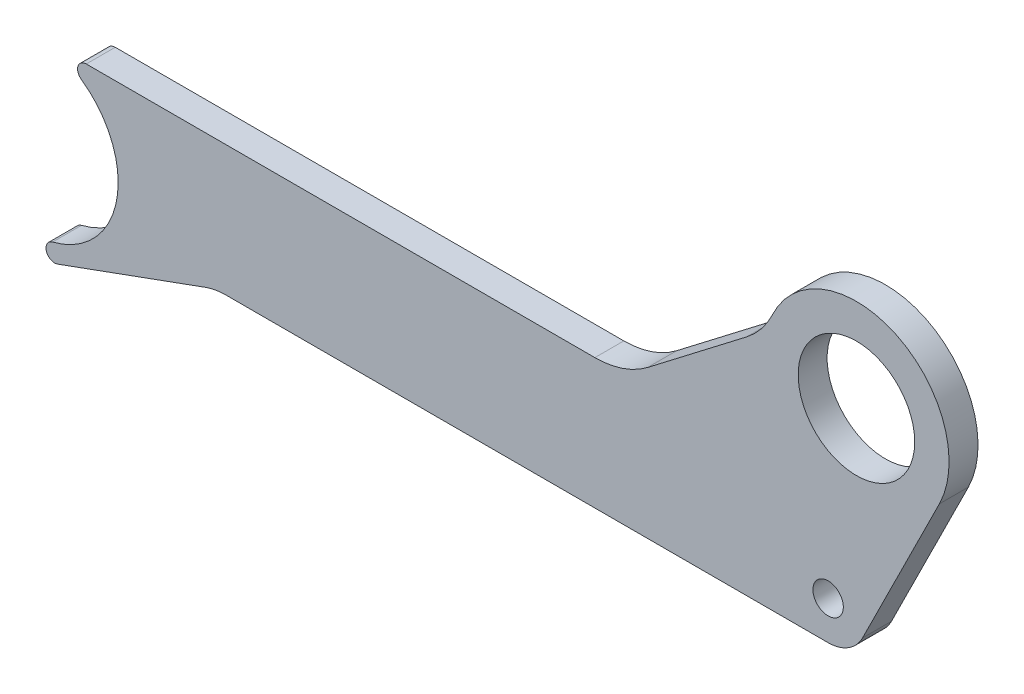
ISO-10303-21;
HEADER;
FILE_DESCRIPTION(('STEP AP214'),'2;1');
FILE_NAME('part.step','',(''),(''),'','','');
FILE_SCHEMA(('AUTOMOTIVE_DESIGN { 1 0 10303 214 1 1 1 1 }'));
ENDSEC;
DATA;
#1=APPLICATION_CONTEXT('core data for automotive mechanical design processes');
#2=APPLICATION_PROTOCOL_DEFINITION('international standard','automotive_design',2000,#1);
#3=PRODUCT_CONTEXT('',#1,'mechanical');
#4=PRODUCT('Part','Part','',(#3));
#5=PRODUCT_RELATED_PRODUCT_CATEGORY('part','',(#4));
#6=PRODUCT_DEFINITION_FORMATION('','',#4);
#7=PRODUCT_DEFINITION_CONTEXT('part definition',#1,'design');
#8=PRODUCT_DEFINITION('design','',#6,#7);
#9=PRODUCT_DEFINITION_SHAPE('','',#8);
#10=(LENGTH_UNIT() NAMED_UNIT(*) SI_UNIT(.MILLI.,.METRE.));
#11=(NAMED_UNIT(*) PLANE_ANGLE_UNIT() SI_UNIT($,.RADIAN.));
#12=(NAMED_UNIT(*) SI_UNIT($,.STERADIAN.) SOLID_ANGLE_UNIT());
#13=UNCERTAINTY_MEASURE_WITH_UNIT(LENGTH_MEASURE(1.E-05),#10,'distance_accuracy_value','');
#14=(GEOMETRIC_REPRESENTATION_CONTEXT(3) GLOBAL_UNCERTAINTY_ASSIGNED_CONTEXT((#13)) GLOBAL_UNIT_ASSIGNED_CONTEXT((#10,
#11,#12)) REPRESENTATION_CONTEXT('',''));
#15=CARTESIAN_POINT('',(0.,0.,0.));
#16=DIRECTION('',(0.,0.,1.));
#17=DIRECTION('',(1.,0.,0.));
#18=AXIS2_PLACEMENT_3D('',#15,#16,#17);
#19=CARTESIAN_POINT('',(-266.02633403899,-33.,10.));
#20=DIRECTION('',(0.,0.,1.));
#21=DIRECTION('',(1.,0.,0.));
#22=AXIS2_PLACEMENT_3D('',#19,#20,#21);
#23=PLANE('',#22);
#24=CARTESIAN_POINT('',(0.,0.,10.));
#25=DIRECTION('',(0.,0.,1.));
#26=DIRECTION('',(1.,0.,0.));
#27=AXIS2_PLACEMENT_3D('',#24,#25,#26);
#28=CIRCLE('',#27,20.125);
#29=CARTESIAN_POINT('',(20.125,0.,10.));
#30=VERTEX_POINT('',#29);
#31=EDGE_CURVE('E174',#30,#30,#28,.T.);
#32=ORIENTED_EDGE('',*,*,#31,.F.);
#33=EDGE_LOOP('',(#32));
#34=FACE_BOUND('',#33,.T.);
#35=CARTESIAN_POINT('',(-266.02633403899,-33.,10.));
#36=DIRECTION('',(0.,0.,1.));
#37=DIRECTION('',(1.,0.,0.));
#38=AXIS2_PLACEMENT_3D('',#35,#36,#37);
#39=CIRCLE('',#38,3.00000000000001);
#40=CARTESIAN_POINT('',(-266.026334038989,-30.,10.));
#41=VERTEX_POINT('',#40);
#42=CARTESIAN_POINT('',(-267.751212762718,-35.4545454545455,10.));
#43=VERTEX_POINT('',#42);
#44=EDGE_CURVE('E195',#41,#43,#39,.T.);
#45=ORIENTED_EDGE('',*,*,#44,.T.);
#46=CARTESIAN_POINT('',(-284.999999999999,-60.,10.));
#47=DIRECTION('',(0.,0.,-1.));
#48=DIRECTION('',(-1.,0.,0.));
#49=AXIS2_PLACEMENT_3D('',#46,#47,#48);
#50=CIRCLE('',#49,30.);
#51=CARTESIAN_POINT('',(-277.670674774274,-89.0909090909091,10.));
#52=VERTEX_POINT('',#51);
#53=EDGE_CURVE('E118',#43,#52,#50,.T.);
#54=ORIENTED_EDGE('',*,*,#53,.T.);
#55=CARTESIAN_POINT('',(-276.937742251701,-92.,10.));
#56=DIRECTION('',(0.,0.,1.));
#57=DIRECTION('',(1.,0.,0.));
#58=AXIS2_PLACEMENT_3D('',#55,#56,#57);
#59=CIRCLE('',#58,2.99999999999999);
#60=CARTESIAN_POINT('',(-275.911681821724,-94.8190778623577,10.));
#61=VERTEX_POINT('',#60);
#62=EDGE_CURVE('E225',#52,#61,#59,.T.);
#63=ORIENTED_EDGE('',*,*,#62,.T.);
#64=DIRECTION('',(0.939692620785908,0.342020143325671,0.));
#65=VECTOR('',#64,1.);
#66=CARTESIAN_POINT('',(-275.911681821724,-94.8190778623577,10.));
#67=LINE('',#66,#65);
#68=CARTESIAN_POINT('',(-224.773076172828,-76.2061475842819,10.));
#69=VERTEX_POINT('',#68);
#70=EDGE_CURVE('E244',#61,#69,#67,.T.);
#71=ORIENTED_EDGE('',*,*,#70,.T.);
#72=CARTESIAN_POINT('',(-217.932673306315,-95.,10.));
#73=DIRECTION('',(0.,0.,-1.));
#74=DIRECTION('',(1.,0.,0.));
#75=AXIS2_PLACEMENT_3D('',#72,#73,#74);
#76=CIRCLE('',#75,20.);
#77=CARTESIAN_POINT('',(-217.932673306315,-75.,10.));
#78=VERTEX_POINT('',#77);
#79=EDGE_CURVE('E241',#69,#78,#76,.T.);
#80=ORIENTED_EDGE('',*,*,#79,.T.);
#81=DIRECTION('',(1.,0.,0.));
#82=VECTOR('',#81,1.);
#83=CARTESIAN_POINT('',(-217.932673306315,-75.,10.));
#84=LINE('',#83,#82);
#85=CARTESIAN_POINT('',(-9.77715406501423,-75.,10.));
#86=VERTEX_POINT('',#85);
#87=EDGE_CURVE('E243',#78,#86,#84,.T.);
#88=ORIENTED_EDGE('',*,*,#87,.T.);
#89=CARTESIAN_POINT('',(-9.77715406501423,-61.7305212871962,10.));
#90=DIRECTION('',(0.,0.,1.));
#91=DIRECTION('',(1.,0.,0.));
#92=AXIS2_PLACEMENT_3D('',#89,#90,#91);
#93=CIRCLE('',#92,13.2694787128039);
#94=CARTESIAN_POINT('',(2.10446710968015,-67.6386634292412,10.));
#95=VERTEX_POINT('',#94);
#96=EDGE_CURVE('E246',#86,#95,#93,.T.);
#97=ORIENTED_EDGE('',*,*,#96,.T.);
#98=DIRECTION('',(0.445242972231018,0.895409792038756,0.));
#99=VECTOR('',#98,1.);
#100=CARTESIAN_POINT('',(2.10446710968015,-67.6386634292412,10.));
#101=LINE('',#100,#99);
#102=CARTESIAN_POINT('',(28.6531133452401,-14.2477751113926,10.));
#103=VERTEX_POINT('',#102);
#104=EDGE_CURVE('E252',#95,#103,#101,.T.);
#105=ORIENTED_EDGE('',*,*,#104,.T.);
#106=CARTESIAN_POINT('',(0.,0.,10.));
#107=DIRECTION('',(0.,0.,1.));
#108=DIRECTION('',(1.,0.,0.));
#109=AXIS2_PLACEMENT_3D('',#106,#107,#108);
#110=CIRCLE('',#109,32.);
#111=CARTESIAN_POINT('',(-28.9993311751464,13.5291829536814,10.));
#112=VERTEX_POINT('',#111);
#113=EDGE_CURVE('E254',#103,#112,#110,.T.);
#114=ORIENTED_EDGE('',*,*,#113,.T.);
#115=CARTESIAN_POINT('',(-56.1862041518462,26.2127919727577,10.));
#116=DIRECTION('',(0.,0.,-1.));
#117=DIRECTION('',(1.,0.,0.));
#118=AXIS2_PLACEMENT_3D('',#115,#116,#117);
#119=CIRCLE('',#118,30.);
#120=CARTESIAN_POINT('',(-37.9233612815846,2.41219176402055,10.));
#121=VERTEX_POINT('',#120);
#122=EDGE_CURVE('E152',#112,#121,#119,.T.);
#123=ORIENTED_EDGE('',*,*,#122,.T.);
#124=DIRECTION('',(-0.793353340291238,-0.608761429008716,0.));
#125=VECTOR('',#124,1.);
#126=CARTESIAN_POINT('',(-37.9233612815846,2.41219176402055,10.));
#127=LINE('',#126,#125);
#128=CARTESIAN_POINT('',(-72.084536873491,-23.8006002087372,10.));
#129=VERTEX_POINT('',#128);
#130=EDGE_CURVE('E146',#121,#129,#127,.T.);
#131=ORIENTED_EDGE('',*,*,#130,.T.);
#132=CARTESIAN_POINT('',(-90.3473797437526,0.,10.));
#133=DIRECTION('',(0.,0.,-1.));
#134=DIRECTION('',(-1.,0.,0.));
#135=AXIS2_PLACEMENT_3D('',#132,#133,#134);
#136=CIRCLE('',#135,30.);
#137=CARTESIAN_POINT('',(-90.3473797437522,-30.,10.));
#138=VERTEX_POINT('',#137);
#139=EDGE_CURVE('E150',#129,#138,#136,.T.);
#140=ORIENTED_EDGE('',*,*,#139,.T.);
#141=DIRECTION('',(-1.,0.,0.));
#142=VECTOR('',#141,1.);
#143=CARTESIAN_POINT('',(-90.3473797437522,-30.,10.));
#144=LINE('',#143,#142);
#145=EDGE_CURVE('E60',#138,#41,#144,.T.);
#146=ORIENTED_EDGE('',*,*,#145,.T.);
#147=EDGE_LOOP('',(#45,#54,#63,#71,#80,#88,#97,#105,#114,#123,#131,#140,#146));
#148=FACE_BOUND('',#147,.T.);
#149=CARTESIAN_POINT('',(-9.77715406501423,-61.7305212871962,10.));
#150=DIRECTION('',(0.,0.,1.));
#151=DIRECTION('',(1.,0.,0.));
#152=AXIS2_PLACEMENT_3D('',#149,#150,#151);
#153=CIRCLE('',#152,5.25);
#154=CARTESIAN_POINT('',(-4.52715406501423,-61.7305212871962,10.));
#155=VERTEX_POINT('',#154);
#156=EDGE_CURVE('E297',#155,#155,#153,.T.);
#157=ORIENTED_EDGE('',*,*,#156,.F.);
#158=EDGE_LOOP('',(#157));
#159=FACE_BOUND('',#158,.T.);
#160=ADVANCED_FACE('F43',(#34,#148,#159),#23,.T.);
#161=CARTESIAN_POINT('',(-266.02633403899,-33.,0.));
#162=DIRECTION('',(0.,0.,1.));
#163=DIRECTION('',(1.,0.,0.));
#164=AXIS2_PLACEMENT_3D('',#161,#162,#163);
#165=PLANE('',#164);
#166=CARTESIAN_POINT('',(0.,0.,0.));
#167=DIRECTION('',(0.,0.,1.));
#168=DIRECTION('',(1.,0.,0.));
#169=AXIS2_PLACEMENT_3D('',#166,#167,#168);
#170=CIRCLE('',#169,20.125);
#171=CARTESIAN_POINT('',(20.125,0.,0.));
#172=VERTEX_POINT('',#171);
#173=EDGE_CURVE('E302',#172,#172,#170,.T.);
#174=ORIENTED_EDGE('',*,*,#173,.T.);
#175=EDGE_LOOP('',(#174));
#176=FACE_BOUND('',#175,.T.);
#177=CARTESIAN_POINT('',(-266.02633403899,-33.,0.));
#178=DIRECTION('',(0.,0.,1.));
#179=DIRECTION('',(1.,0.,0.));
#180=AXIS2_PLACEMENT_3D('',#177,#178,#179);
#181=CIRCLE('',#180,3.00000000000001);
#182=CARTESIAN_POINT('',(-266.026334038989,-30.,0.));
#183=VERTEX_POINT('',#182);
#184=CARTESIAN_POINT('',(-267.751212762718,-35.4545454545455,0.));
#185=VERTEX_POINT('',#184);
#186=EDGE_CURVE('E170',#183,#185,#181,.T.);
#187=ORIENTED_EDGE('',*,*,#186,.F.);
#188=DIRECTION('',(-1.,0.,0.));
#189=VECTOR('',#188,1.);
#190=CARTESIAN_POINT('',(-90.3473797437522,-30.,0.));
#191=LINE('',#190,#189);
#192=CARTESIAN_POINT('',(-90.3473797437522,-30.,0.));
#193=VERTEX_POINT('',#192);
#194=EDGE_CURVE('E110',#193,#183,#191,.T.);
#195=ORIENTED_EDGE('',*,*,#194,.F.);
#196=CARTESIAN_POINT('',(-90.3473797437526,0.,0.));
#197=DIRECTION('',(0.,0.,-1.));
#198=DIRECTION('',(-1.,0.,0.));
#199=AXIS2_PLACEMENT_3D('',#196,#197,#198);
#200=CIRCLE('',#199,30.);
#201=CARTESIAN_POINT('',(-72.084536873491,-23.8006002087372,0.));
#202=VERTEX_POINT('',#201);
#203=EDGE_CURVE('E104',#202,#193,#200,.T.);
#204=ORIENTED_EDGE('',*,*,#203,.F.);
#205=DIRECTION('',(-0.793353340291238,-0.608761429008716,0.));
#206=VECTOR('',#205,1.);
#207=CARTESIAN_POINT('',(-37.9233612815846,2.41219176402055,0.));
#208=LINE('',#207,#206);
#209=CARTESIAN_POINT('',(-37.9233612815846,2.41219176402055,0.));
#210=VERTEX_POINT('',#209);
#211=EDGE_CURVE('E160',#210,#202,#208,.T.);
#212=ORIENTED_EDGE('',*,*,#211,.F.);
#213=CARTESIAN_POINT('',(-56.1862041518462,26.2127919727577,0.));
#214=DIRECTION('',(0.,0.,-1.));
#215=DIRECTION('',(1.,0.,0.));
#216=AXIS2_PLACEMENT_3D('',#213,#214,#215);
#217=CIRCLE('',#216,30.);
#218=CARTESIAN_POINT('',(-28.9993311751464,13.5291829536814,0.));
#219=VERTEX_POINT('',#218);
#220=EDGE_CURVE('E190',#219,#210,#217,.T.);
#221=ORIENTED_EDGE('',*,*,#220,.F.);
#222=CARTESIAN_POINT('',(0.,0.,0.));
#223=DIRECTION('',(0.,0.,1.));
#224=DIRECTION('',(1.,0.,0.));
#225=AXIS2_PLACEMENT_3D('',#222,#223,#224);
#226=CIRCLE('',#225,32.);
#227=CARTESIAN_POINT('',(28.6531133452401,-14.2477751113926,0.));
#228=VERTEX_POINT('',#227);
#229=EDGE_CURVE('E188',#228,#219,#226,.T.);
#230=ORIENTED_EDGE('',*,*,#229,.F.);
#231=DIRECTION('',(0.445242972231018,0.895409792038756,0.));
#232=VECTOR('',#231,1.);
#233=CARTESIAN_POINT('',(2.10446710968015,-67.6386634292412,0.));
#234=LINE('',#233,#232);
#235=CARTESIAN_POINT('',(2.10446710968015,-67.6386634292412,0.));
#236=VERTEX_POINT('',#235);
#237=EDGE_CURVE('E186',#236,#228,#234,.T.);
#238=ORIENTED_EDGE('',*,*,#237,.F.);
#239=CARTESIAN_POINT('',(-9.77715406501423,-61.7305212871962,0.));
#240=DIRECTION('',(0.,0.,1.));
#241=DIRECTION('',(1.,0.,0.));
#242=AXIS2_PLACEMENT_3D('',#239,#240,#241);
#243=CIRCLE('',#242,13.2694787128039);
#244=CARTESIAN_POINT('',(-9.77715406501423,-75.,0.));
#245=VERTEX_POINT('',#244);
#246=EDGE_CURVE('E184',#245,#236,#243,.T.);
#247=ORIENTED_EDGE('',*,*,#246,.F.);
#248=DIRECTION('',(1.,0.,0.));
#249=VECTOR('',#248,1.);
#250=CARTESIAN_POINT('',(-217.932673306315,-75.,0.));
#251=LINE('',#250,#249);
#252=CARTESIAN_POINT('',(-217.932673306315,-75.,0.));
#253=VERTEX_POINT('',#252);
#254=EDGE_CURVE('E182',#253,#245,#251,.T.);
#255=ORIENTED_EDGE('',*,*,#254,.F.);
#256=CARTESIAN_POINT('',(-217.932673306315,-95.,0.));
#257=DIRECTION('',(0.,0.,-1.));
#258=DIRECTION('',(1.,0.,0.));
#259=AXIS2_PLACEMENT_3D('',#256,#257,#258);
#260=CIRCLE('',#259,20.);
#261=CARTESIAN_POINT('',(-224.773076172828,-76.2061475842819,0.));
#262=VERTEX_POINT('',#261);
#263=EDGE_CURVE('E180',#262,#253,#260,.T.);
#264=ORIENTED_EDGE('',*,*,#263,.F.);
#265=DIRECTION('',(0.939692620785908,0.342020143325671,0.));
#266=VECTOR('',#265,1.);
#267=CARTESIAN_POINT('',(-275.911681821724,-94.8190778623577,0.));
#268=LINE('',#267,#266);
#269=CARTESIAN_POINT('',(-275.911681821724,-94.8190778623577,0.));
#270=VERTEX_POINT('',#269);
#271=EDGE_CURVE('E178',#270,#262,#268,.T.);
#272=ORIENTED_EDGE('',*,*,#271,.F.);
#273=CARTESIAN_POINT('',(-276.937742251701,-92.,0.));
#274=DIRECTION('',(0.,0.,1.));
#275=DIRECTION('',(1.,0.,0.));
#276=AXIS2_PLACEMENT_3D('',#273,#274,#275);
#277=CIRCLE('',#276,2.99999999999999);
#278=CARTESIAN_POINT('',(-277.670674774274,-89.0909090909091,0.));
#279=VERTEX_POINT('',#278);
#280=EDGE_CURVE('E176',#279,#270,#277,.T.);
#281=ORIENTED_EDGE('',*,*,#280,.F.);
#282=CARTESIAN_POINT('',(-284.999999999999,-60.,0.));
#283=DIRECTION('',(0.,0.,-1.));
#284=DIRECTION('',(-1.,0.,0.));
#285=AXIS2_PLACEMENT_3D('',#282,#283,#284);
#286=CIRCLE('',#285,30.);
#287=EDGE_CURVE('E173',#185,#279,#286,.T.);
#288=ORIENTED_EDGE('',*,*,#287,.F.);
#289=EDGE_LOOP('',(#187,#195,#204,#212,#221,#230,#238,#247,#255,#264,#272,#281,#288));
#290=FACE_BOUND('',#289,.T.);
#291=CARTESIAN_POINT('',(-9.77715406501423,-61.7305212871962,0.));
#292=DIRECTION('',(0.,0.,1.));
#293=DIRECTION('',(1.,0.,0.));
#294=AXIS2_PLACEMENT_3D('',#291,#292,#293);
#295=CIRCLE('',#294,5.25);
#296=CARTESIAN_POINT('',(-4.52715406501423,-61.7305212871962,0.));
#297=VERTEX_POINT('',#296);
#298=EDGE_CURVE('E300',#297,#297,#295,.T.);
#299=ORIENTED_EDGE('',*,*,#298,.T.);
#300=EDGE_LOOP('',(#299));
#301=FACE_BOUND('',#300,.T.);
#302=ADVANCED_FACE('F229',(#176,#290,#301),#165,.F.);
#303=CARTESIAN_POINT('',(-266.02633403899,-33.,10.));
#304=DIRECTION('',(0.,0.,-1.));
#305=DIRECTION('',(-1.,0.,0.));
#306=AXIS2_PLACEMENT_3D('',#303,#304,#305);
#307=CYLINDRICAL_SURFACE('',#306,3.00000000000001);
#308=ORIENTED_EDGE('',*,*,#186,.T.);
#309=DIRECTION('',(0.,0.,-1.));
#310=VECTOR('',#309,1.);
#311=CARTESIAN_POINT('',(-267.751212762718,-35.4545454545455,10.));
#312=LINE('',#311,#310);
#313=EDGE_CURVE('E11',#43,#185,#312,.T.);
#314=ORIENTED_EDGE('',*,*,#313,.F.);
#315=ORIENTED_EDGE('',*,*,#44,.F.);
#316=DIRECTION('',(0.,0.,-1.));
#317=VECTOR('',#316,1.);
#318=CARTESIAN_POINT('',(-266.026334038989,-30.,10.));
#319=LINE('',#318,#317);
#320=EDGE_CURVE('E166',#41,#183,#319,.T.);
#321=ORIENTED_EDGE('',*,*,#320,.T.);
#322=EDGE_LOOP('',(#308,#314,#315,#321));
#323=FACE_BOUND('',#322,.T.);
#324=ADVANCED_FACE('F45',(#323),#307,.T.);
#325=CARTESIAN_POINT('',(-284.999999999999,-60.,10.));
#326=DIRECTION('',(0.,0.,-1.));
#327=DIRECTION('',(-1.,0.,0.));
#328=AXIS2_PLACEMENT_3D('',#325,#326,#327);
#329=CYLINDRICAL_SURFACE('',#328,30.);
#330=ORIENTED_EDGE('',*,*,#287,.T.);
#331=DIRECTION('',(0.,0.,-1.));
#332=VECTOR('',#331,1.);
#333=CARTESIAN_POINT('',(-277.670674774274,-89.0909090909091,10.));
#334=LINE('',#333,#332);
#335=EDGE_CURVE('E52',#52,#279,#334,.T.);
#336=ORIENTED_EDGE('',*,*,#335,.F.);
#337=ORIENTED_EDGE('',*,*,#53,.F.);
#338=ORIENTED_EDGE('',*,*,#313,.T.);
#339=EDGE_LOOP('',(#330,#336,#337,#338));
#340=FACE_BOUND('',#339,.T.);
#341=ADVANCED_FACE('F383',(#340),#329,.F.);
#342=CARTESIAN_POINT('',(-276.937742251701,-92.,10.));
#343=DIRECTION('',(0.,0.,-1.));
#344=DIRECTION('',(-1.,0.,0.));
#345=AXIS2_PLACEMENT_3D('',#342,#343,#344);
#346=CYLINDRICAL_SURFACE('',#345,2.99999999999999);
#347=ORIENTED_EDGE('',*,*,#280,.T.);
#348=DIRECTION('',(0.,0.,-1.));
#349=VECTOR('',#348,1.);
#350=CARTESIAN_POINT('',(-275.911681821724,-94.8190778623577,10.));
#351=LINE('',#350,#349);
#352=EDGE_CURVE('E217',#61,#270,#351,.T.);
#353=ORIENTED_EDGE('',*,*,#352,.F.);
#354=ORIENTED_EDGE('',*,*,#62,.F.);
#355=ORIENTED_EDGE('',*,*,#335,.T.);
#356=EDGE_LOOP('',(#347,#353,#354,#355));
#357=FACE_BOUND('',#356,.T.);
#358=ADVANCED_FACE('F223',(#357),#346,.T.);
#359=CARTESIAN_POINT('',(-275.911681821724,-94.8190778623577,10.));
#360=DIRECTION('',(-0.342020143325671,0.939692620785908,0.));
#361=DIRECTION('',(-0.939692620785908,-0.342020143325671,0.));
#362=AXIS2_PLACEMENT_3D('',#359,#360,#361);
#363=PLANE('',#362);
#364=ORIENTED_EDGE('',*,*,#271,.T.);
#365=DIRECTION('',(0.,0.,-1.));
#366=VECTOR('',#365,1.);
#367=CARTESIAN_POINT('',(-224.773076172828,-76.2061475842819,10.));
#368=LINE('',#367,#366);
#369=EDGE_CURVE('E214',#69,#262,#368,.T.);
#370=ORIENTED_EDGE('',*,*,#369,.F.);
#371=ORIENTED_EDGE('',*,*,#70,.F.);
#372=ORIENTED_EDGE('',*,*,#352,.T.);
#373=EDGE_LOOP('',(#364,#370,#371,#372));
#374=FACE_BOUND('',#373,.T.);
#375=ADVANCED_FACE('F235',(#374),#363,.F.);
#376=CARTESIAN_POINT('',(-217.932673306315,-95.,10.));
#377=DIRECTION('',(0.,0.,-1.));
#378=DIRECTION('',(-1.,0.,0.));
#379=AXIS2_PLACEMENT_3D('',#376,#377,#378);
#380=CYLINDRICAL_SURFACE('',#379,20.);
#381=ORIENTED_EDGE('',*,*,#263,.T.);
#382=DIRECTION('',(0.,0.,-1.));
#383=VECTOR('',#382,1.);
#384=CARTESIAN_POINT('',(-217.932673306315,-75.,10.));
#385=LINE('',#384,#383);
#386=EDGE_CURVE('E211',#78,#253,#385,.T.);
#387=ORIENTED_EDGE('',*,*,#386,.F.);
#388=ORIENTED_EDGE('',*,*,#79,.F.);
#389=ORIENTED_EDGE('',*,*,#369,.T.);
#390=EDGE_LOOP('',(#381,#387,#388,#389));
#391=FACE_BOUND('',#390,.T.);
#392=ADVANCED_FACE('F239',(#391),#380,.F.);
#393=CARTESIAN_POINT('',(-217.932673306315,-75.,10.));
#394=DIRECTION('',(0.,1.,0.));
#395=DIRECTION('',(-1.,0.,0.));
#396=AXIS2_PLACEMENT_3D('',#393,#394,#395);
#397=PLANE('',#396);
#398=ORIENTED_EDGE('',*,*,#254,.T.);
#399=DIRECTION('',(0.,0.,-1.));
#400=VECTOR('',#399,1.);
#401=CARTESIAN_POINT('',(-9.77715406501423,-75.,10.));
#402=LINE('',#401,#400);
#403=EDGE_CURVE('E208',#86,#245,#402,.T.);
#404=ORIENTED_EDGE('',*,*,#403,.F.);
#405=ORIENTED_EDGE('',*,*,#87,.F.);
#406=ORIENTED_EDGE('',*,*,#386,.T.);
#407=EDGE_LOOP('',(#398,#404,#405,#406));
#408=FACE_BOUND('',#407,.T.);
#409=ADVANCED_FACE('F356',(#408),#397,.F.);
#410=CARTESIAN_POINT('',(-9.77715406501423,-61.7305212871962,10.));
#411=DIRECTION('',(0.,0.,-1.));
#412=DIRECTION('',(-1.,0.,0.));
#413=AXIS2_PLACEMENT_3D('',#410,#411,#412);
#414=CYLINDRICAL_SURFACE('',#413,13.2694787128039);
#415=ORIENTED_EDGE('',*,*,#246,.T.);
#416=DIRECTION('',(0.,0.,-1.));
#417=VECTOR('',#416,1.);
#418=CARTESIAN_POINT('',(2.10446710968015,-67.6386634292412,10.));
#419=LINE('',#418,#417);
#420=EDGE_CURVE('E205',#95,#236,#419,.T.);
#421=ORIENTED_EDGE('',*,*,#420,.F.);
#422=ORIENTED_EDGE('',*,*,#96,.F.);
#423=ORIENTED_EDGE('',*,*,#403,.T.);
#424=EDGE_LOOP('',(#415,#421,#422,#423));
#425=FACE_BOUND('',#424,.T.);
#426=ADVANCED_FACE('F348',(#425),#414,.T.);
#427=CARTESIAN_POINT('',(2.10446710968015,-67.6386634292412,10.));
#428=DIRECTION('',(-0.895409792038756,0.445242972231018,0.));
#429=DIRECTION('',(-0.445242972231018,-0.895409792038756,0.));
#430=AXIS2_PLACEMENT_3D('',#427,#428,#429);
#431=PLANE('',#430);
#432=ORIENTED_EDGE('',*,*,#237,.T.);
#433=DIRECTION('',(0.,0.,-1.));
#434=VECTOR('',#433,1.);
#435=CARTESIAN_POINT('',(28.6531133452401,-14.2477751113926,10.));
#436=LINE('',#435,#434);
#437=EDGE_CURVE('E202',#103,#228,#436,.T.);
#438=ORIENTED_EDGE('',*,*,#437,.F.);
#439=ORIENTED_EDGE('',*,*,#104,.F.);
#440=ORIENTED_EDGE('',*,*,#420,.T.);
#441=EDGE_LOOP('',(#432,#438,#439,#440));
#442=FACE_BOUND('',#441,.T.);
#443=ADVANCED_FACE('F341',(#442),#431,.F.);
#444=CARTESIAN_POINT('',(0.,0.,10.));
#445=DIRECTION('',(0.,0.,-1.));
#446=DIRECTION('',(-1.,0.,0.));
#447=AXIS2_PLACEMENT_3D('',#444,#445,#446);
#448=CYLINDRICAL_SURFACE('',#447,32.);
#449=ORIENTED_EDGE('',*,*,#229,.T.);
#450=DIRECTION('',(0.,0.,-1.));
#451=VECTOR('',#450,1.);
#452=CARTESIAN_POINT('',(-28.9993311751464,13.5291829536814,10.));
#453=LINE('',#452,#451);
#454=EDGE_CURVE('E199',#112,#219,#453,.T.);
#455=ORIENTED_EDGE('',*,*,#454,.F.);
#456=ORIENTED_EDGE('',*,*,#113,.F.);
#457=ORIENTED_EDGE('',*,*,#437,.T.);
#458=EDGE_LOOP('',(#449,#455,#456,#457));
#459=FACE_BOUND('',#458,.T.);
#460=ADVANCED_FACE('F260',(#459),#448,.T.);
#461=CARTESIAN_POINT('',(-56.1862041518462,26.2127919727577,10.));
#462=DIRECTION('',(0.,0.,-1.));
#463=DIRECTION('',(-1.,0.,0.));
#464=AXIS2_PLACEMENT_3D('',#461,#462,#463);
#465=CYLINDRICAL_SURFACE('',#464,30.);
#466=ORIENTED_EDGE('',*,*,#220,.T.);
#467=DIRECTION('',(0.,0.,-1.));
#468=VECTOR('',#467,1.);
#469=CARTESIAN_POINT('',(-37.9233612815846,2.41219176402055,10.));
#470=LINE('',#469,#468);
#471=EDGE_CURVE('E161',#121,#210,#470,.T.);
#472=ORIENTED_EDGE('',*,*,#471,.F.);
#473=ORIENTED_EDGE('',*,*,#122,.F.);
#474=ORIENTED_EDGE('',*,*,#454,.T.);
#475=EDGE_LOOP('',(#466,#472,#473,#474));
#476=FACE_BOUND('',#475,.T.);
#477=ADVANCED_FACE('F264',(#476),#465,.F.);
#478=CARTESIAN_POINT('',(-37.9233612815846,2.41219176402055,10.));
#479=DIRECTION('',(0.608761429008716,-0.793353340291238,0.));
#480=DIRECTION('',(0.793353340291238,0.608761429008716,0.));
#481=AXIS2_PLACEMENT_3D('',#478,#479,#480);
#482=PLANE('',#481);
#483=ORIENTED_EDGE('',*,*,#211,.T.);
#484=DIRECTION('',(0.,0.,-1.));
#485=VECTOR('',#484,1.);
#486=CARTESIAN_POINT('',(-72.084536873491,-23.8006002087372,10.));
#487=LINE('',#486,#485);
#488=EDGE_CURVE('E157',#129,#202,#487,.T.);
#489=ORIENTED_EDGE('',*,*,#488,.F.);
#490=ORIENTED_EDGE('',*,*,#130,.F.);
#491=ORIENTED_EDGE('',*,*,#471,.T.);
#492=EDGE_LOOP('',(#483,#489,#490,#491));
#493=FACE_BOUND('',#492,.T.);
#494=ADVANCED_FACE('F158',(#493),#482,.F.);
#495=CARTESIAN_POINT('',(-90.3473797437526,0.,10.));
#496=DIRECTION('',(0.,0.,-1.));
#497=DIRECTION('',(-1.,0.,0.));
#498=AXIS2_PLACEMENT_3D('',#495,#496,#497);
#499=CYLINDRICAL_SURFACE('',#498,30.);
#500=ORIENTED_EDGE('',*,*,#203,.T.);
#501=DIRECTION('',(0.,0.,-1.));
#502=VECTOR('',#501,1.);
#503=CARTESIAN_POINT('',(-90.3473797437522,-30.,10.));
#504=LINE('',#503,#502);
#505=EDGE_CURVE('E162',#138,#193,#504,.T.);
#506=ORIENTED_EDGE('',*,*,#505,.F.);
#507=ORIENTED_EDGE('',*,*,#139,.F.);
#508=ORIENTED_EDGE('',*,*,#488,.T.);
#509=EDGE_LOOP('',(#500,#506,#507,#508));
#510=FACE_BOUND('',#509,.T.);
#511=ADVANCED_FACE('F164',(#510),#499,.F.);
#512=CARTESIAN_POINT('',(-90.3473797437522,-30.,10.));
#513=DIRECTION('',(0.,-1.,0.));
#514=DIRECTION('',(1.,0.,0.));
#515=AXIS2_PLACEMENT_3D('',#512,#513,#514);
#516=PLANE('',#515);
#517=ORIENTED_EDGE('',*,*,#194,.T.);
#518=ORIENTED_EDGE('',*,*,#320,.F.);
#519=ORIENTED_EDGE('',*,*,#145,.F.);
#520=ORIENTED_EDGE('',*,*,#505,.T.);
#521=EDGE_LOOP('',(#517,#518,#519,#520));
#522=FACE_BOUND('',#521,.T.);
#523=ADVANCED_FACE('F268',(#522),#516,.F.);
#524=CARTESIAN_POINT('',(0.,0.,10.));
#525=DIRECTION('',(0.,0.,-1.));
#526=DIRECTION('',(-1.,0.,0.));
#527=AXIS2_PLACEMENT_3D('',#524,#525,#526);
#528=CYLINDRICAL_SURFACE('',#527,20.125);
#529=ORIENTED_EDGE('',*,*,#31,.T.);
#530=EDGE_LOOP('',(#529));
#531=FACE_BOUND('',#530,.T.);
#532=ORIENTED_EDGE('',*,*,#173,.F.);
#533=EDGE_LOOP('',(#532));
#534=FACE_BOUND('',#533,.T.);
#535=ADVANCED_FACE('F270',(#531,#534),#528,.F.);
#536=CARTESIAN_POINT('',(-9.77715406501423,-61.7305212871962,10.));
#537=DIRECTION('',(0.,0.,-1.));
#538=DIRECTION('',(-1.,0.,0.));
#539=AXIS2_PLACEMENT_3D('',#536,#537,#538);
#540=CYLINDRICAL_SURFACE('',#539,5.25);
#541=ORIENTED_EDGE('',*,*,#156,.T.);
#542=EDGE_LOOP('',(#541));
#543=FACE_BOUND('',#542,.T.);
#544=ORIENTED_EDGE('',*,*,#298,.F.);
#545=EDGE_LOOP('',(#544));
#546=FACE_BOUND('',#545,.T.);
#547=ADVANCED_FACE('F276',(#543,#546),#540,.F.);
#548=CLOSED_SHELL('',(#160,#302,#324,#341,#358,#375,#392,#409,#426,#443,#460,#477,#494,#511,
#523,#535,#547));
#549=MANIFOLD_SOLID_BREP('B2',#548);
#550=ADVANCED_BREP_SHAPE_REPRESENTATION('',(#18,#549),#14);
#551=SHAPE_DEFINITION_REPRESENTATION(#9,#550);
ENDSEC;
END-ISO-10303-21;
